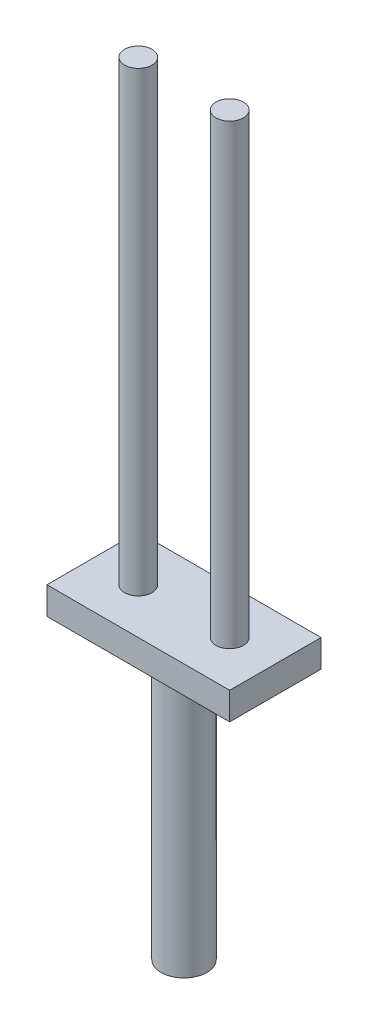
ISO-10303-21;
HEADER;
FILE_DESCRIPTION(('STEP AP214'),'2;1');
FILE_NAME('part.step','',(''),(''),'','','');
FILE_SCHEMA(('AUTOMOTIVE_DESIGN { 1 0 10303 214 1 1 1 1 }'));
ENDSEC;
DATA;
#1=APPLICATION_CONTEXT('core data for automotive mechanical design processes');
#2=APPLICATION_PROTOCOL_DEFINITION('international standard','automotive_design',2000,#1);
#3=PRODUCT_CONTEXT('',#1,'mechanical');
#4=PRODUCT('Part','Part','',(#3));
#5=PRODUCT_RELATED_PRODUCT_CATEGORY('part','',(#4));
#6=PRODUCT_DEFINITION_FORMATION('','',#4);
#7=PRODUCT_DEFINITION_CONTEXT('part definition',#1,'design');
#8=PRODUCT_DEFINITION('design','',#6,#7);
#9=PRODUCT_DEFINITION_SHAPE('','',#8);
#10=(LENGTH_UNIT() NAMED_UNIT(*) SI_UNIT(.MILLI.,.METRE.));
#11=(NAMED_UNIT(*) PLANE_ANGLE_UNIT() SI_UNIT($,.RADIAN.));
#12=(NAMED_UNIT(*) SI_UNIT($,.STERADIAN.) SOLID_ANGLE_UNIT());
#13=UNCERTAINTY_MEASURE_WITH_UNIT(LENGTH_MEASURE(1.E-05),#10,'distance_accuracy_value','');
#14=(GEOMETRIC_REPRESENTATION_CONTEXT(3) GLOBAL_UNCERTAINTY_ASSIGNED_CONTEXT((#13)) GLOBAL_UNIT_ASSIGNED_CONTEXT((#10,
#11,#12)) REPRESENTATION_CONTEXT('',''));
#15=CARTESIAN_POINT('',(0.,0.,0.));
#16=DIRECTION('',(0.,0.,1.));
#17=DIRECTION('',(1.,0.,0.));
#18=AXIS2_PLACEMENT_3D('',#15,#16,#17);
#19=CARTESIAN_POINT('',(10.,3.,-5.));
#20=DIRECTION('',(-1.,0.,0.));
#21=DIRECTION('',(0.,0.,1.));
#22=AXIS2_PLACEMENT_3D('',#19,#20,#21);
#23=PLANE('',#22);
#24=DIRECTION('',(0.,0.,-1.));
#25=VECTOR('',#24,1.);
#26=CARTESIAN_POINT('',(10.,0.,-5.));
#27=LINE('',#26,#25);
#28=CARTESIAN_POINT('',(10.,0.,5.));
#29=VERTEX_POINT('',#28);
#30=CARTESIAN_POINT('',(10.,0.,-5.));
#31=VERTEX_POINT('',#30);
#32=EDGE_CURVE('E100',#29,#31,#27,.T.);
#33=ORIENTED_EDGE('',*,*,#32,.T.);
#34=DIRECTION('',(0.,-1.,0.));
#35=VECTOR('',#34,1.);
#36=CARTESIAN_POINT('',(10.,3.,-5.));
#37=LINE('',#36,#35);
#38=CARTESIAN_POINT('',(10.,3.,-5.));
#39=VERTEX_POINT('',#38);
#40=EDGE_CURVE('E37',#39,#31,#37,.T.);
#41=ORIENTED_EDGE('',*,*,#40,.F.);
#42=DIRECTION('',(0.,0.,-1.));
#43=VECTOR('',#42,1.);
#44=CARTESIAN_POINT('',(10.,3.,-5.));
#45=LINE('',#44,#43);
#46=CARTESIAN_POINT('',(10.,3.,5.));
#47=VERTEX_POINT('',#46);
#48=EDGE_CURVE('E87',#47,#39,#45,.T.);
#49=ORIENTED_EDGE('',*,*,#48,.F.);
#50=DIRECTION('',(0.,-1.,0.));
#51=VECTOR('',#50,1.);
#52=CARTESIAN_POINT('',(10.,3.,5.));
#53=LINE('',#52,#51);
#54=EDGE_CURVE('E96',#47,#29,#53,.T.);
#55=ORIENTED_EDGE('',*,*,#54,.T.);
#56=EDGE_LOOP('',(#33,#41,#49,#55));
#57=FACE_BOUND('',#56,.T.);
#58=ADVANCED_FACE('F34',(#57),#23,.F.);
#59=CARTESIAN_POINT('',(-10.,3.,-5.));
#60=DIRECTION('',(0.,0.,1.));
#61=DIRECTION('',(1.,0.,0.));
#62=AXIS2_PLACEMENT_3D('',#59,#60,#61);
#63=PLANE('',#62);
#64=DIRECTION('',(-1.,0.,0.));
#65=VECTOR('',#64,1.);
#66=CARTESIAN_POINT('',(-10.,0.,-5.));
#67=LINE('',#66,#65);
#68=CARTESIAN_POINT('',(-10.,0.,-5.));
#69=VERTEX_POINT('',#68);
#70=EDGE_CURVE('E92',#31,#69,#67,.T.);
#71=ORIENTED_EDGE('',*,*,#70,.T.);
#72=DIRECTION('',(0.,-1.,0.));
#73=VECTOR('',#72,1.);
#74=CARTESIAN_POINT('',(-10.,3.,-5.));
#75=LINE('',#74,#73);
#76=CARTESIAN_POINT('',(-10.,3.,-5.));
#77=VERTEX_POINT('',#76);
#78=EDGE_CURVE('E90',#77,#69,#75,.T.);
#79=ORIENTED_EDGE('',*,*,#78,.F.);
#80=DIRECTION('',(-1.,0.,0.));
#81=VECTOR('',#80,1.);
#82=CARTESIAN_POINT('',(-10.,3.,-5.));
#83=LINE('',#82,#81);
#84=EDGE_CURVE('E82',#39,#77,#83,.T.);
#85=ORIENTED_EDGE('',*,*,#84,.F.);
#86=ORIENTED_EDGE('',*,*,#40,.T.);
#87=EDGE_LOOP('',(#71,#79,#85,#86));
#88=FACE_BOUND('',#87,.T.);
#89=ADVANCED_FACE('F91',(#88),#63,.F.);
#90=CARTESIAN_POINT('',(-10.,3.,-5.));
#91=DIRECTION('',(1.,0.,0.));
#92=DIRECTION('',(0.,0.,-1.));
#93=AXIS2_PLACEMENT_3D('',#90,#91,#92);
#94=PLANE('',#93);
#95=DIRECTION('',(0.,0.,1.));
#96=VECTOR('',#95,1.);
#97=CARTESIAN_POINT('',(-10.,0.,-5.));
#98=LINE('',#97,#96);
#99=CARTESIAN_POINT('',(-10.,0.,5.));
#100=VERTEX_POINT('',#99);
#101=EDGE_CURVE('E68',#69,#100,#98,.T.);
#102=ORIENTED_EDGE('',*,*,#101,.T.);
#103=DIRECTION('',(0.,-1.,0.));
#104=VECTOR('',#103,1.);
#105=CARTESIAN_POINT('',(-10.,3.,5.));
#106=LINE('',#105,#104);
#107=CARTESIAN_POINT('',(-10.,3.,5.));
#108=VERTEX_POINT('',#107);
#109=EDGE_CURVE('E93',#108,#100,#106,.T.);
#110=ORIENTED_EDGE('',*,*,#109,.F.);
#111=DIRECTION('',(0.,0.,1.));
#112=VECTOR('',#111,1.);
#113=CARTESIAN_POINT('',(-10.,3.,-5.));
#114=LINE('',#113,#112);
#115=EDGE_CURVE('E85',#77,#108,#114,.T.);
#116=ORIENTED_EDGE('',*,*,#115,.F.);
#117=ORIENTED_EDGE('',*,*,#78,.T.);
#118=EDGE_LOOP('',(#102,#110,#116,#117));
#119=FACE_BOUND('',#118,.T.);
#120=ADVANCED_FACE('F94',(#119),#94,.F.);
#121=CARTESIAN_POINT('',(-10.,3.,5.));
#122=DIRECTION('',(0.,0.,-1.));
#123=DIRECTION('',(-1.,0.,0.));
#124=AXIS2_PLACEMENT_3D('',#121,#122,#123);
#125=PLANE('',#124);
#126=DIRECTION('',(1.,0.,0.));
#127=VECTOR('',#126,1.);
#128=CARTESIAN_POINT('',(-10.,0.,5.));
#129=LINE('',#128,#127);
#130=EDGE_CURVE('E74',#100,#29,#129,.T.);
#131=ORIENTED_EDGE('',*,*,#130,.T.);
#132=ORIENTED_EDGE('',*,*,#54,.F.);
#133=DIRECTION('',(1.,0.,0.));
#134=VECTOR('',#133,1.);
#135=CARTESIAN_POINT('',(-10.,3.,5.));
#136=LINE('',#135,#134);
#137=EDGE_CURVE('E51',#108,#47,#136,.T.);
#138=ORIENTED_EDGE('',*,*,#137,.F.);
#139=ORIENTED_EDGE('',*,*,#109,.T.);
#140=EDGE_LOOP('',(#131,#132,#138,#139));
#141=FACE_BOUND('',#140,.T.);
#142=ADVANCED_FACE('F108',(#141),#125,.F.);
#143=CARTESIAN_POINT('',(0.,3.,0.));
#144=DIRECTION('',(0.,1.,0.));
#145=DIRECTION('',(0.,0.,1.));
#146=AXIS2_PLACEMENT_3D('',#143,#144,#145);
#147=PLANE('',#146);
#148=CARTESIAN_POINT('',(5.,3.,0.));
#149=DIRECTION('',(0.,1.,0.));
#150=DIRECTION('',(0.,0.,-1.));
#151=AXIS2_PLACEMENT_3D('',#148,#149,#150);
#152=CIRCLE('',#151,1.5);
#153=CARTESIAN_POINT('',(5.,3.,-1.5));
#154=VERTEX_POINT('',#153);
#155=EDGE_CURVE('E120',#154,#154,#152,.T.);
#156=ORIENTED_EDGE('',*,*,#155,.F.);
#157=EDGE_LOOP('',(#156));
#158=FACE_BOUND('',#157,.T.);
#159=CARTESIAN_POINT('',(-5.,3.,0.));
#160=DIRECTION('',(0.,1.,0.));
#161=DIRECTION('',(0.,0.,1.));
#162=AXIS2_PLACEMENT_3D('',#159,#160,#161);
#163=CIRCLE('',#162,1.5);
#164=CARTESIAN_POINT('',(-5.,3.,1.5));
#165=VERTEX_POINT('',#164);
#166=EDGE_CURVE('E114',#165,#165,#163,.T.);
#167=ORIENTED_EDGE('',*,*,#166,.F.);
#168=EDGE_LOOP('',(#167));
#169=FACE_BOUND('',#168,.T.);
#170=ORIENTED_EDGE('',*,*,#48,.T.);
#171=ORIENTED_EDGE('',*,*,#84,.T.);
#172=ORIENTED_EDGE('',*,*,#115,.T.);
#173=ORIENTED_EDGE('',*,*,#137,.T.);
#174=EDGE_LOOP('',(#170,#171,#172,#173));
#175=FACE_BOUND('',#174,.T.);
#176=ADVANCED_FACE('F83',(#158,#169,#175),#147,.T.);
#177=CARTESIAN_POINT('',(0.,0.,0.));
#178=DIRECTION('',(0.,1.,0.));
#179=DIRECTION('',(0.,0.,1.));
#180=AXIS2_PLACEMENT_3D('',#177,#178,#179);
#181=PLANE('',#180);
#182=CARTESIAN_POINT('',(0.,0.,0.));
#183=DIRECTION('',(0.,-1.,0.));
#184=DIRECTION('',(0.,0.,-1.));
#185=AXIS2_PLACEMENT_3D('',#182,#183,#184);
#186=CIRCLE('',#185,2.5);
#187=CARTESIAN_POINT('',(0.,0.,-2.5));
#188=VERTEX_POINT('',#187);
#189=EDGE_CURVE('E11',#188,#188,#186,.T.);
#190=ORIENTED_EDGE('',*,*,#189,.F.);
#191=EDGE_LOOP('',(#190));
#192=FACE_BOUND('',#191,.T.);
#193=ORIENTED_EDGE('',*,*,#32,.F.);
#194=ORIENTED_EDGE('',*,*,#130,.F.);
#195=ORIENTED_EDGE('',*,*,#101,.F.);
#196=ORIENTED_EDGE('',*,*,#70,.F.);
#197=EDGE_LOOP('',(#193,#194,#195,#196));
#198=FACE_BOUND('',#197,.T.);
#199=ADVANCED_FACE('F111',(#192,#198),#181,.F.);
#200=CARTESIAN_POINT('',(-5.,53.,0.));
#201=DIRECTION('',(0.,-1.,0.));
#202=DIRECTION('',(0.,0.,-1.));
#203=AXIS2_PLACEMENT_3D('',#200,#201,#202);
#204=CYLINDRICAL_SURFACE('',#203,1.5);
#205=CARTESIAN_POINT('',(-5.,53.,0.));
#206=DIRECTION('',(0.,1.,0.));
#207=DIRECTION('',(0.,0.,1.));
#208=AXIS2_PLACEMENT_3D('',#205,#206,#207);
#209=CIRCLE('',#208,1.5);
#210=CARTESIAN_POINT('',(-5.,53.,1.5));
#211=VERTEX_POINT('',#210);
#212=EDGE_CURVE('E103',#211,#211,#209,.T.);
#213=ORIENTED_EDGE('',*,*,#212,.F.);
#214=EDGE_LOOP('',(#213));
#215=FACE_BOUND('',#214,.T.);
#216=ORIENTED_EDGE('',*,*,#166,.T.);
#217=EDGE_LOOP('',(#216));
#218=FACE_BOUND('',#217,.T.);
#219=ADVANCED_FACE('F139',(#215,#218),#204,.T.);
#220=CARTESIAN_POINT('',(-5.,53.,0.));
#221=DIRECTION('',(0.,1.,0.));
#222=DIRECTION('',(0.,0.,1.));
#223=AXIS2_PLACEMENT_3D('',#220,#221,#222);
#224=PLANE('',#223);
#225=ORIENTED_EDGE('',*,*,#212,.T.);
#226=EDGE_LOOP('',(#225));
#227=FACE_BOUND('',#226,.T.);
#228=ADVANCED_FACE('F145',(#227),#224,.T.);
#229=CARTESIAN_POINT('',(5.,53.,0.));
#230=DIRECTION('',(0.,-1.,0.));
#231=DIRECTION('',(0.,0.,-1.));
#232=AXIS2_PLACEMENT_3D('',#229,#230,#231);
#233=CYLINDRICAL_SURFACE('',#232,1.5);
#234=CARTESIAN_POINT('',(5.,53.,0.));
#235=DIRECTION('',(0.,1.,0.));
#236=DIRECTION('',(0.,0.,-1.));
#237=AXIS2_PLACEMENT_3D('',#234,#235,#236);
#238=CIRCLE('',#237,1.5);
#239=CARTESIAN_POINT('',(5.,53.,-1.5));
#240=VERTEX_POINT('',#239);
#241=EDGE_CURVE('E117',#240,#240,#238,.T.);
#242=ORIENTED_EDGE('',*,*,#241,.F.);
#243=EDGE_LOOP('',(#242));
#244=FACE_BOUND('',#243,.T.);
#245=ORIENTED_EDGE('',*,*,#155,.T.);
#246=EDGE_LOOP('',(#245));
#247=FACE_BOUND('',#246,.T.);
#248=ADVANCED_FACE('F184',(#244,#247),#233,.T.);
#249=CARTESIAN_POINT('',(5.,53.,0.));
#250=DIRECTION('',(0.,-1.,0.));
#251=DIRECTION('',(0.,0.,-1.));
#252=AXIS2_PLACEMENT_3D('',#249,#250,#251);
#253=PLANE('',#252);
#254=ORIENTED_EDGE('',*,*,#241,.T.);
#255=EDGE_LOOP('',(#254));
#256=FACE_BOUND('',#255,.T.);
#257=ADVANCED_FACE('F134',(#256),#253,.F.);
#258=CARTESIAN_POINT('',(0.,-30.,0.));
#259=DIRECTION('',(0.,1.,0.));
#260=DIRECTION('',(0.,0.,1.));
#261=AXIS2_PLACEMENT_3D('',#258,#259,#260);
#262=CYLINDRICAL_SURFACE('',#261,2.5);
#263=CARTESIAN_POINT('',(0.,-30.,0.));
#264=DIRECTION('',(0.,-1.,0.));
#265=DIRECTION('',(0.,0.,-1.));
#266=AXIS2_PLACEMENT_3D('',#263,#264,#265);
#267=CIRCLE('',#266,2.5);
#268=CARTESIAN_POINT('',(0.,-30.,-2.5));
#269=VERTEX_POINT('',#268);
#270=EDGE_CURVE('E123',#269,#269,#267,.T.);
#271=ORIENTED_EDGE('',*,*,#270,.F.);
#272=EDGE_LOOP('',(#271));
#273=FACE_BOUND('',#272,.T.);
#274=ORIENTED_EDGE('',*,*,#189,.T.);
#275=EDGE_LOOP('',(#274));
#276=FACE_BOUND('',#275,.T.);
#277=ADVANCED_FACE('F131',(#273,#276),#262,.T.);
#278=CARTESIAN_POINT('',(0.,-30.,0.));
#279=DIRECTION('',(0.,-1.,0.));
#280=DIRECTION('',(0.,0.,-1.));
#281=AXIS2_PLACEMENT_3D('',#278,#279,#280);
#282=PLANE('',#281);
#283=ORIENTED_EDGE('',*,*,#270,.T.);
#284=EDGE_LOOP('',(#283));
#285=FACE_BOUND('',#284,.T.);
#286=ADVANCED_FACE('F129',(#285),#282,.T.);
#287=CLOSED_SHELL('',(#58,#89,#120,#142,#176,#199,#219,#228,#248,#257,#277,#286));
#288=MANIFOLD_SOLID_BREP('B2',#287);
#289=ADVANCED_BREP_SHAPE_REPRESENTATION('',(#18,#288),#14);
#290=SHAPE_DEFINITION_REPRESENTATION(#9,#289);
ENDSEC;
END-ISO-10303-21;
